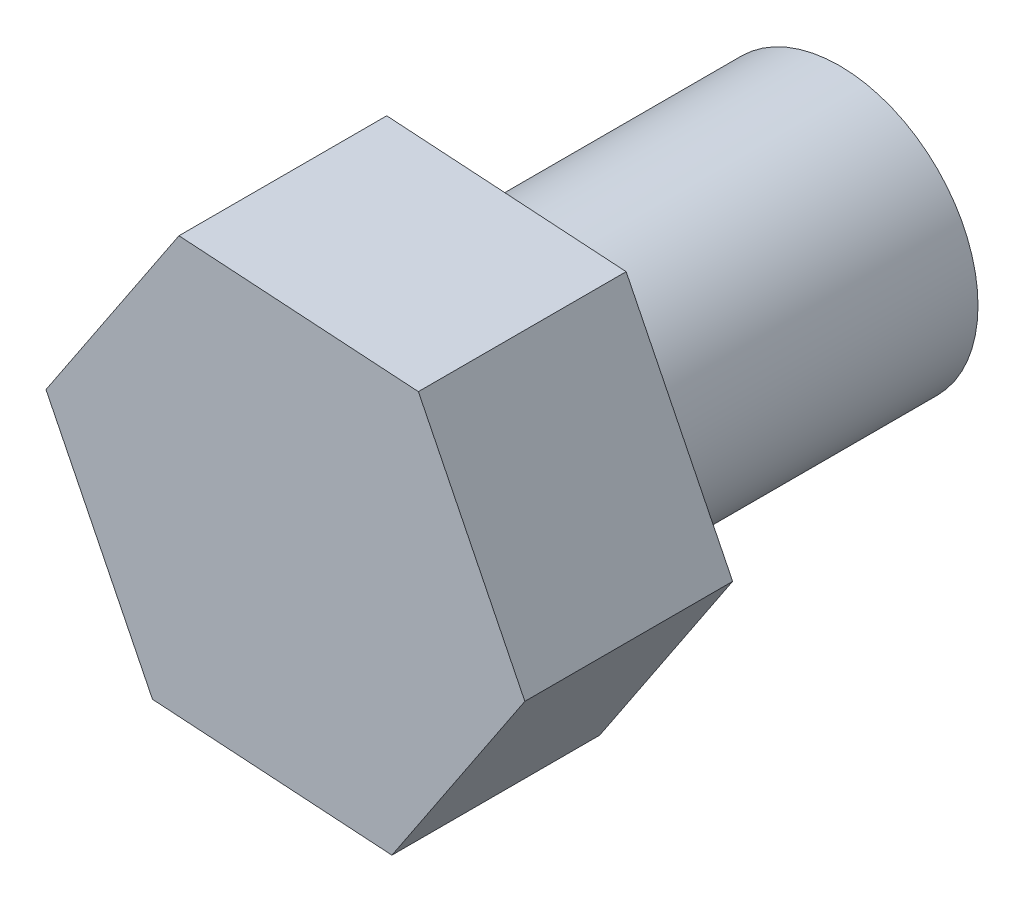
ISO-10303-21;
HEADER;
FILE_DESCRIPTION(('STEP AP214'),'2;1');
FILE_NAME('part.step','',(''),(''),'','','');
FILE_SCHEMA(('AUTOMOTIVE_DESIGN { 1 0 10303 214 1 1 1 1 }'));
ENDSEC;
DATA;
#1=APPLICATION_CONTEXT('core data for automotive mechanical design processes');
#2=APPLICATION_PROTOCOL_DEFINITION('international standard','automotive_design',2000,#1);
#3=PRODUCT_CONTEXT('',#1,'mechanical');
#4=PRODUCT('Part','Part','',(#3));
#5=PRODUCT_RELATED_PRODUCT_CATEGORY('part','',(#4));
#6=PRODUCT_DEFINITION_FORMATION('','',#4);
#7=PRODUCT_DEFINITION_CONTEXT('part definition',#1,'design');
#8=PRODUCT_DEFINITION('design','',#6,#7);
#9=PRODUCT_DEFINITION_SHAPE('','',#8);
#10=(LENGTH_UNIT() NAMED_UNIT(*) SI_UNIT(.MILLI.,.METRE.));
#11=(NAMED_UNIT(*) PLANE_ANGLE_UNIT() SI_UNIT($,.RADIAN.));
#12=(NAMED_UNIT(*) SI_UNIT($,.STERADIAN.) SOLID_ANGLE_UNIT());
#13=UNCERTAINTY_MEASURE_WITH_UNIT(LENGTH_MEASURE(1.E-05),#10,'distance_accuracy_value','');
#14=(GEOMETRIC_REPRESENTATION_CONTEXT(3) GLOBAL_UNCERTAINTY_ASSIGNED_CONTEXT((#13)) GLOBAL_UNIT_ASSIGNED_CONTEXT((#10,
#11,#12)) REPRESENTATION_CONTEXT('',''));
#15=CARTESIAN_POINT('',(0.,0.,0.));
#16=DIRECTION('',(0.,0.,1.));
#17=DIRECTION('',(1.,0.,0.));
#18=AXIS2_PLACEMENT_3D('',#15,#16,#17);
#19=CARTESIAN_POINT('',(1.53737826762693,-3.10426610686463,0.));
#20=DIRECTION('',(0.,0.,1.));
#21=DIRECTION('',(1.,0.,0.));
#22=AXIS2_PLACEMENT_3D('',#19,#20,#21);
#23=PLANE('',#22);
#24=DIRECTION('',(0.997967965881328,-0.0637176512018894,0.));
#25=VECTOR('',#24,1.);
#26=CARTESIAN_POINT('',(-1.91968417483831,-2.88354168842338,0.));
#27=LINE('',#26,#25);
#28=CARTESIAN_POINT('',(-1.91968417483831,-2.88354168842338,0.));
#29=VERTEX_POINT('',#28);
#30=CARTESIAN_POINT('',(1.53737826762693,-3.10426610686463,0.));
#31=VERTEX_POINT('',#30);
#32=EDGE_CURVE('E117',#29,#31,#27,.T.);
#33=ORIENTED_EDGE('',*,*,#32,.F.);
#34=DIRECTION('',(0.44380287833035,-0.896124436217257,0.));
#35=VECTOR('',#34,1.);
#36=CARTESIAN_POINT('',(-3.45706244246527,0.22072441844125,0.));
#37=LINE('',#36,#35);
#38=CARTESIAN_POINT('',(-3.45706244246527,0.22072441844125,0.));
#39=VERTEX_POINT('',#38);
#40=EDGE_CURVE('E77',#39,#29,#37,.T.);
#41=ORIENTED_EDGE('',*,*,#40,.F.);
#42=DIRECTION('',(-0.554165087550976,-0.832406785015366,0.));
#43=VECTOR('',#42,1.);
#44=CARTESIAN_POINT('',(-1.53737826762695,3.10426610686464,0.));
#45=LINE('',#44,#43);
#46=CARTESIAN_POINT('',(-1.53737826762695,3.10426610686464,0.));
#47=VERTEX_POINT('',#46);
#48=EDGE_CURVE('E71',#47,#39,#45,.T.);
#49=ORIENTED_EDGE('',*,*,#48,.F.);
#50=DIRECTION('',(-0.997967965881327,0.0637176512018897,0.));
#51=VECTOR('',#50,1.);
#52=CARTESIAN_POINT('',(1.91968417483827,2.88354168842339,0.));
#53=LINE('',#52,#51);
#54=CARTESIAN_POINT('',(1.91968417483827,2.88354168842339,0.));
#55=VERTEX_POINT('',#54);
#56=EDGE_CURVE('E107',#55,#47,#53,.T.);
#57=ORIENTED_EDGE('',*,*,#56,.F.);
#58=DIRECTION('',(-0.443802878330351,0.896124436217256,0.));
#59=VECTOR('',#58,1.);
#60=CARTESIAN_POINT('',(3.45706244246524,-0.220724418441245,0.));
#61=LINE('',#60,#59);
#62=CARTESIAN_POINT('',(3.45706244246524,-0.220724418441245,0.));
#63=VERTEX_POINT('',#62);
#64=EDGE_CURVE('E123',#63,#55,#61,.T.);
#65=ORIENTED_EDGE('',*,*,#64,.F.);
#66=DIRECTION('',(0.554165087550976,0.832406785015367,0.));
#67=VECTOR('',#66,1.);
#68=CARTESIAN_POINT('',(1.53737826762693,-3.10426610686463,0.));
#69=LINE('',#68,#67);
#70=EDGE_CURVE('E120',#31,#63,#69,.T.);
#71=ORIENTED_EDGE('',*,*,#70,.F.);
#72=EDGE_LOOP('',(#33,#41,#49,#57,#65,#71));
#73=FACE_BOUND('',#72,.T.);
#74=CARTESIAN_POINT('',(0.,0.,0.));
#75=DIRECTION('',(0.,0.,1.));
#76=DIRECTION('',(1.,0.,0.));
#77=AXIS2_PLACEMENT_3D('',#74,#75,#76);
#78=CIRCLE('',#77,2.);
#79=CARTESIAN_POINT('',(2.,0.,0.));
#80=VERTEX_POINT('',#79);
#81=EDGE_CURVE('E11',#80,#80,#78,.F.);
#82=ORIENTED_EDGE('',*,*,#81,.F.);
#83=EDGE_LOOP('',(#82));
#84=FACE_BOUND('',#83,.T.);
#85=ADVANCED_FACE('F31',(#73,#84),#23,.F.);
#86=CARTESIAN_POINT('',(-1.91968417483831,-2.88354168842338,3.));
#87=DIRECTION('',(0.0637176512018894,0.997967965881327,0.));
#88=DIRECTION('',(-0.997967965881328,0.0637176512018894,0.));
#89=AXIS2_PLACEMENT_3D('',#86,#87,#88);
#90=PLANE('',#89);
#91=ORIENTED_EDGE('',*,*,#32,.T.);
#92=DIRECTION('',(0.,0.,-1.));
#93=VECTOR('',#92,1.);
#94=CARTESIAN_POINT('',(1.53737826762693,-3.10426610686463,3.));
#95=LINE('',#94,#93);
#96=CARTESIAN_POINT('',(1.53737826762693,-3.10426610686463,3.));
#97=VERTEX_POINT('',#96);
#98=EDGE_CURVE('E40',#97,#31,#95,.T.);
#99=ORIENTED_EDGE('',*,*,#98,.F.);
#100=DIRECTION('',(0.997967965881328,-0.0637176512018894,0.));
#101=VECTOR('',#100,1.);
#102=CARTESIAN_POINT('',(-1.91968417483831,-2.88354168842338,3.));
#103=LINE('',#102,#101);
#104=CARTESIAN_POINT('',(-1.91968417483831,-2.88354168842338,3.));
#105=VERTEX_POINT('',#104);
#106=EDGE_CURVE('E128',#105,#97,#103,.T.);
#107=ORIENTED_EDGE('',*,*,#106,.F.);
#108=DIRECTION('',(0.,0.,-1.));
#109=VECTOR('',#108,1.);
#110=CARTESIAN_POINT('',(-1.91968417483831,-2.88354168842338,3.));
#111=LINE('',#110,#109);
#112=EDGE_CURVE('E113',#105,#29,#111,.T.);
#113=ORIENTED_EDGE('',*,*,#112,.T.);
#114=EDGE_LOOP('',(#91,#99,#107,#113));
#115=FACE_BOUND('',#114,.T.);
#116=ADVANCED_FACE('F33',(#115),#90,.F.);
#117=CARTESIAN_POINT('',(1.53737826762693,-3.10426610686463,3.));
#118=DIRECTION('',(-0.832406785015367,0.554165087550976,0.));
#119=DIRECTION('',(-0.554165087550976,-0.832406785015367,0.));
#120=AXIS2_PLACEMENT_3D('',#117,#118,#119);
#121=PLANE('',#120);
#122=ORIENTED_EDGE('',*,*,#70,.T.);
#123=DIRECTION('',(0.,0.,-1.));
#124=VECTOR('',#123,1.);
#125=CARTESIAN_POINT('',(3.45706244246524,-0.220724418441245,3.));
#126=LINE('',#125,#124);
#127=CARTESIAN_POINT('',(3.45706244246524,-0.220724418441245,3.));
#128=VERTEX_POINT('',#127);
#129=EDGE_CURVE('E132',#128,#63,#126,.T.);
#130=ORIENTED_EDGE('',*,*,#129,.F.);
#131=DIRECTION('',(0.554165087550976,0.832406785015367,0.));
#132=VECTOR('',#131,1.);
#133=CARTESIAN_POINT('',(1.53737826762693,-3.10426610686463,3.));
#134=LINE('',#133,#132);
#135=EDGE_CURVE('E86',#97,#128,#134,.T.);
#136=ORIENTED_EDGE('',*,*,#135,.F.);
#137=ORIENTED_EDGE('',*,*,#98,.T.);
#138=EDGE_LOOP('',(#122,#130,#136,#137));
#139=FACE_BOUND('',#138,.T.);
#140=ADVANCED_FACE('F135',(#139),#121,.F.);
#141=CARTESIAN_POINT('',(3.45706244246524,-0.220724418441245,3.));
#142=DIRECTION('',(-0.896124436217256,-0.443802878330351,0.));
#143=DIRECTION('',(0.443802878330351,-0.896124436217256,0.));
#144=AXIS2_PLACEMENT_3D('',#141,#142,#143);
#145=PLANE('',#144);
#146=ORIENTED_EDGE('',*,*,#64,.T.);
#147=DIRECTION('',(0.,0.,-1.));
#148=VECTOR('',#147,1.);
#149=CARTESIAN_POINT('',(1.91968417483827,2.88354168842339,3.));
#150=LINE('',#149,#148);
#151=CARTESIAN_POINT('',(1.91968417483827,2.88354168842339,3.));
#152=VERTEX_POINT('',#151);
#153=EDGE_CURVE('E108',#152,#55,#150,.T.);
#154=ORIENTED_EDGE('',*,*,#153,.F.);
#155=DIRECTION('',(-0.443802878330351,0.896124436217256,0.));
#156=VECTOR('',#155,1.);
#157=CARTESIAN_POINT('',(3.45706244246524,-0.220724418441245,3.));
#158=LINE('',#157,#156);
#159=EDGE_CURVE('E99',#128,#152,#158,.T.);
#160=ORIENTED_EDGE('',*,*,#159,.F.);
#161=ORIENTED_EDGE('',*,*,#129,.T.);
#162=EDGE_LOOP('',(#146,#154,#160,#161));
#163=FACE_BOUND('',#162,.T.);
#164=ADVANCED_FACE('F143',(#163),#145,.F.);
#165=CARTESIAN_POINT('',(1.91968417483827,2.88354168842339,3.));
#166=DIRECTION('',(-0.0637176512018897,-0.997967965881328,0.));
#167=DIRECTION('',(0.997967965881328,-0.0637176512018897,0.));
#168=AXIS2_PLACEMENT_3D('',#165,#166,#167);
#169=PLANE('',#168);
#170=ORIENTED_EDGE('',*,*,#56,.T.);
#171=DIRECTION('',(0.,0.,-1.));
#172=VECTOR('',#171,1.);
#173=CARTESIAN_POINT('',(-1.53737826762695,3.10426610686464,3.));
#174=LINE('',#173,#172);
#175=CARTESIAN_POINT('',(-1.53737826762695,3.10426610686464,3.));
#176=VERTEX_POINT('',#175);
#177=EDGE_CURVE('E104',#176,#47,#174,.T.);
#178=ORIENTED_EDGE('',*,*,#177,.F.);
#179=DIRECTION('',(-0.997967965881327,0.0637176512018897,0.));
#180=VECTOR('',#179,1.);
#181=CARTESIAN_POINT('',(1.91968417483827,2.88354168842339,3.));
#182=LINE('',#181,#180);
#183=EDGE_CURVE('E93',#152,#176,#182,.T.);
#184=ORIENTED_EDGE('',*,*,#183,.F.);
#185=ORIENTED_EDGE('',*,*,#153,.T.);
#186=EDGE_LOOP('',(#170,#178,#184,#185));
#187=FACE_BOUND('',#186,.T.);
#188=ADVANCED_FACE('F105',(#187),#169,.F.);
#189=CARTESIAN_POINT('',(-1.53737826762695,3.10426610686464,3.));
#190=DIRECTION('',(0.832406785015366,-0.554165087550977,0.));
#191=DIRECTION('',(0.554165087550977,0.832406785015367,0.));
#192=AXIS2_PLACEMENT_3D('',#189,#190,#191);
#193=PLANE('',#192);
#194=ORIENTED_EDGE('',*,*,#48,.T.);
#195=DIRECTION('',(0.,0.,-1.));
#196=VECTOR('',#195,1.);
#197=CARTESIAN_POINT('',(-3.45706244246527,0.22072441844125,3.));
#198=LINE('',#197,#196);
#199=CARTESIAN_POINT('',(-3.45706244246527,0.22072441844125,3.));
#200=VERTEX_POINT('',#199);
#201=EDGE_CURVE('E109',#200,#39,#198,.T.);
#202=ORIENTED_EDGE('',*,*,#201,.F.);
#203=DIRECTION('',(-0.554165087550976,-0.832406785015366,0.));
#204=VECTOR('',#203,1.);
#205=CARTESIAN_POINT('',(-1.53737826762695,3.10426610686464,3.));
#206=LINE('',#205,#204);
#207=EDGE_CURVE('E97',#176,#200,#206,.T.);
#208=ORIENTED_EDGE('',*,*,#207,.F.);
#209=ORIENTED_EDGE('',*,*,#177,.T.);
#210=EDGE_LOOP('',(#194,#202,#208,#209));
#211=FACE_BOUND('',#210,.T.);
#212=ADVANCED_FACE('F111',(#211),#193,.F.);
#213=CARTESIAN_POINT('',(-3.45706244246527,0.22072441844125,3.));
#214=DIRECTION('',(0.896124436217257,0.44380287833035,0.));
#215=DIRECTION('',(-0.44380287833035,0.896124436217257,0.));
#216=AXIS2_PLACEMENT_3D('',#213,#214,#215);
#217=PLANE('',#216);
#218=ORIENTED_EDGE('',*,*,#40,.T.);
#219=ORIENTED_EDGE('',*,*,#112,.F.);
#220=DIRECTION('',(0.44380287833035,-0.896124436217257,0.));
#221=VECTOR('',#220,1.);
#222=CARTESIAN_POINT('',(-3.45706244246527,0.22072441844125,3.));
#223=LINE('',#222,#221);
#224=EDGE_CURVE('E48',#200,#105,#223,.T.);
#225=ORIENTED_EDGE('',*,*,#224,.F.);
#226=ORIENTED_EDGE('',*,*,#201,.T.);
#227=EDGE_LOOP('',(#218,#219,#225,#226));
#228=FACE_BOUND('',#227,.T.);
#229=ADVANCED_FACE('F164',(#228),#217,.F.);
#230=CARTESIAN_POINT('',(1.53737826762693,-3.10426610686463,3.));
#231=DIRECTION('',(0.,0.,1.));
#232=DIRECTION('',(1.,0.,0.));
#233=AXIS2_PLACEMENT_3D('',#230,#231,#232);
#234=PLANE('',#233);
#235=ORIENTED_EDGE('',*,*,#106,.T.);
#236=ORIENTED_EDGE('',*,*,#135,.T.);
#237=ORIENTED_EDGE('',*,*,#159,.T.);
#238=ORIENTED_EDGE('',*,*,#183,.T.);
#239=ORIENTED_EDGE('',*,*,#207,.T.);
#240=ORIENTED_EDGE('',*,*,#224,.T.);
#241=EDGE_LOOP('',(#235,#236,#237,#238,#239,#240));
#242=FACE_BOUND('',#241,.T.);
#243=ADVANCED_FACE('F95',(#242),#234,.T.);
#244=CARTESIAN_POINT('',(0.,0.,-5.));
#245=DIRECTION('',(0.,0.,1.));
#246=DIRECTION('',(1.,0.,0.));
#247=AXIS2_PLACEMENT_3D('',#244,#245,#246);
#248=CYLINDRICAL_SURFACE('',#247,2.);
#249=CARTESIAN_POINT('',(0.,0.,-5.));
#250=DIRECTION('',(0.,0.,-1.));
#251=DIRECTION('',(-1.,0.,0.));
#252=AXIS2_PLACEMENT_3D('',#249,#250,#251);
#253=CIRCLE('',#252,2.);
#254=CARTESIAN_POINT('',(-2.,0.,-5.));
#255=VERTEX_POINT('',#254);
#256=EDGE_CURVE('E121',#255,#255,#253,.T.);
#257=ORIENTED_EDGE('',*,*,#256,.F.);
#258=EDGE_LOOP('',(#257));
#259=FACE_BOUND('',#258,.T.);
#260=ORIENTED_EDGE('',*,*,#81,.T.);
#261=EDGE_LOOP('',(#260));
#262=FACE_BOUND('',#261,.T.);
#263=ADVANCED_FACE('F152',(#259,#262),#248,.T.);
#264=CARTESIAN_POINT('',(0.,0.,-5.));
#265=DIRECTION('',(0.,0.,-1.));
#266=DIRECTION('',(-1.,0.,0.));
#267=AXIS2_PLACEMENT_3D('',#264,#265,#266);
#268=PLANE('',#267);
#269=ORIENTED_EDGE('',*,*,#256,.T.);
#270=EDGE_LOOP('',(#269));
#271=FACE_BOUND('',#270,.T.);
#272=ADVANCED_FACE('F150',(#271),#268,.T.);
#273=CLOSED_SHELL('',(#85,#116,#140,#164,#188,#212,#229,#243,#263,#272));
#274=MANIFOLD_SOLID_BREP('B2',#273);
#275=ADVANCED_BREP_SHAPE_REPRESENTATION('',(#18,#274),#14);
#276=SHAPE_DEFINITION_REPRESENTATION(#9,#275);
ENDSEC;
END-ISO-10303-21;
